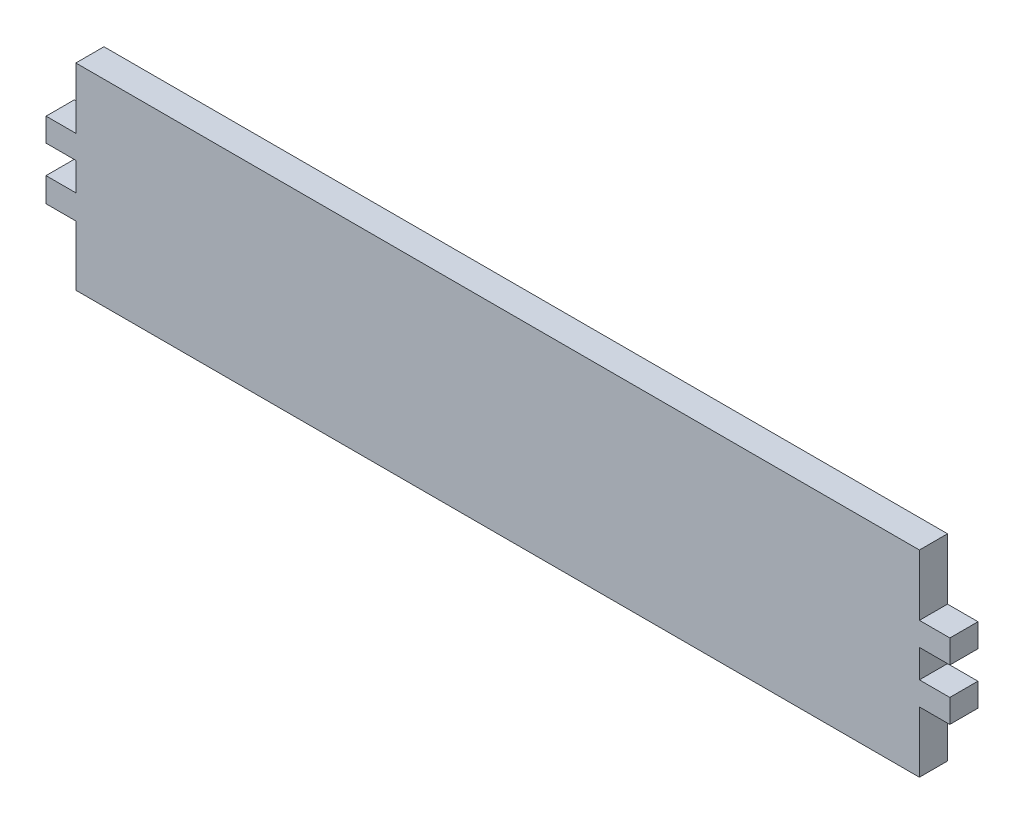
ISO-10303-21;
HEADER;
FILE_DESCRIPTION(('STEP AP214'),'2;1');
FILE_NAME('part.step','',(''),(''),'','','');
FILE_SCHEMA(('AUTOMOTIVE_DESIGN { 1 0 10303 214 1 1 1 1 }'));
ENDSEC;
DATA;
#1=APPLICATION_CONTEXT('core data for automotive mechanical design processes');
#2=APPLICATION_PROTOCOL_DEFINITION('international standard','automotive_design',2000,#1);
#3=PRODUCT_CONTEXT('',#1,'mechanical');
#4=PRODUCT('Part','Part','',(#3));
#5=PRODUCT_RELATED_PRODUCT_CATEGORY('part','',(#4));
#6=PRODUCT_DEFINITION_FORMATION('','',#4);
#7=PRODUCT_DEFINITION_CONTEXT('part definition',#1,'design');
#8=PRODUCT_DEFINITION('design','',#6,#7);
#9=PRODUCT_DEFINITION_SHAPE('','',#8);
#10=(LENGTH_UNIT() NAMED_UNIT(*) SI_UNIT(.MILLI.,.METRE.));
#11=(NAMED_UNIT(*) PLANE_ANGLE_UNIT() SI_UNIT($,.RADIAN.));
#12=(NAMED_UNIT(*) SI_UNIT($,.STERADIAN.) SOLID_ANGLE_UNIT());
#13=UNCERTAINTY_MEASURE_WITH_UNIT(LENGTH_MEASURE(1.E-05),#10,'distance_accuracy_value','');
#14=(GEOMETRIC_REPRESENTATION_CONTEXT(3) GLOBAL_UNCERTAINTY_ASSIGNED_CONTEXT((#13)) GLOBAL_UNIT_ASSIGNED_CONTEXT((#10,
#11,#12)) REPRESENTATION_CONTEXT('',''));
#15=CARTESIAN_POINT('',(0.,0.,0.));
#16=DIRECTION('',(0.,0.,1.));
#17=DIRECTION('',(1.,0.,0.));
#18=AXIS2_PLACEMENT_3D('',#15,#16,#17);
#19=CARTESIAN_POINT('',(-59.917123056119,16.2044558603052,6.));
#20=DIRECTION('',(1.,0.,0.));
#21=DIRECTION('',(0.,0.,-1.));
#22=AXIS2_PLACEMENT_3D('',#19,#20,#21);
#23=PLANE('',#22);
#24=DIRECTION('',(0.,-1.,0.));
#25=VECTOR('',#24,1.);
#26=CARTESIAN_POINT('',(-59.917123056119,16.2044558603052,0.));
#27=LINE('',#26,#25);
#28=CARTESIAN_POINT('',(-59.917123056119,29.2044558603051,0.));
#29=VERTEX_POINT('',#28);
#30=CARTESIAN_POINT('',(-59.917123056119,16.2044558603052,0.));
#31=VERTEX_POINT('',#30);
#32=EDGE_CURVE('E212',#29,#31,#27,.T.);
#33=ORIENTED_EDGE('',*,*,#32,.T.);
#34=DIRECTION('',(0.,0.,-1.));
#35=VECTOR('',#34,1.);
#36=CARTESIAN_POINT('',(-59.917123056119,16.2044558603052,6.));
#37=LINE('',#36,#35);
#38=CARTESIAN_POINT('',(-59.917123056119,16.2044558603052,6.));
#39=VERTEX_POINT('',#38);
#40=EDGE_CURVE('E11',#39,#31,#37,.T.);
#41=ORIENTED_EDGE('',*,*,#40,.F.);
#42=DIRECTION('',(0.,-1.,0.));
#43=VECTOR('',#42,1.);
#44=CARTESIAN_POINT('',(-59.917123056119,16.2044558603052,6.));
#45=LINE('',#44,#43);
#46=CARTESIAN_POINT('',(-59.917123056119,29.2044558603051,6.));
#47=VERTEX_POINT('',#46);
#48=EDGE_CURVE('E270',#47,#39,#45,.T.);
#49=ORIENTED_EDGE('',*,*,#48,.F.);
#50=DIRECTION('',(0.,0.,-1.));
#51=VECTOR('',#50,1.);
#52=CARTESIAN_POINT('',(-59.917123056119,29.2044558603051,6.));
#53=LINE('',#52,#51);
#54=EDGE_CURVE('E208',#47,#29,#53,.T.);
#55=ORIENTED_EDGE('',*,*,#54,.T.);
#56=EDGE_LOOP('',(#33,#41,#49,#55));
#57=FACE_BOUND('',#56,.T.);
#58=ADVANCED_FACE('F39',(#57),#23,.F.);
#59=CARTESIAN_POINT('',(-66.2684019347983,16.2044558603052,6.));
#60=DIRECTION('',(0.,-1.,0.));
#61=DIRECTION('',(0.,0.,-1.));
#62=AXIS2_PLACEMENT_3D('',#59,#60,#61);
#63=PLANE('',#62);
#64=DIRECTION('',(-1.,0.,0.));
#65=VECTOR('',#64,1.);
#66=CARTESIAN_POINT('',(-66.2684019347983,16.2044558603052,0.));
#67=LINE('',#66,#65);
#68=CARTESIAN_POINT('',(-66.2684019347983,16.2044558603052,0.));
#69=VERTEX_POINT('',#68);
#70=EDGE_CURVE('E216',#31,#69,#67,.T.);
#71=ORIENTED_EDGE('',*,*,#70,.T.);
#72=DIRECTION('',(0.,0.,-1.));
#73=VECTOR('',#72,1.);
#74=CARTESIAN_POINT('',(-66.2684019347983,16.2044558603052,6.));
#75=LINE('',#74,#73);
#76=CARTESIAN_POINT('',(-66.2684019347983,16.2044558603052,6.));
#77=VERTEX_POINT('',#76);
#78=EDGE_CURVE('E48',#77,#69,#75,.T.);
#79=ORIENTED_EDGE('',*,*,#78,.F.);
#80=DIRECTION('',(-1.,0.,0.));
#81=VECTOR('',#80,1.);
#82=CARTESIAN_POINT('',(-66.2684019347983,16.2044558603052,6.));
#83=LINE('',#82,#81);
#84=EDGE_CURVE('E135',#39,#77,#83,.T.);
#85=ORIENTED_EDGE('',*,*,#84,.F.);
#86=ORIENTED_EDGE('',*,*,#40,.T.);
#87=EDGE_LOOP('',(#71,#79,#85,#86));
#88=FACE_BOUND('',#87,.T.);
#89=ADVANCED_FACE('F420',(#88),#63,.F.);
#90=CARTESIAN_POINT('',(-66.2684019347983,11.2044558603052,6.));
#91=DIRECTION('',(1.,0.,0.));
#92=DIRECTION('',(0.,0.,-1.));
#93=AXIS2_PLACEMENT_3D('',#90,#91,#92);
#94=PLANE('',#93);
#95=DIRECTION('',(0.,-1.,0.));
#96=VECTOR('',#95,1.);
#97=CARTESIAN_POINT('',(-66.2684019347983,11.2044558603052,0.));
#98=LINE('',#97,#96);
#99=CARTESIAN_POINT('',(-66.2684019347983,11.2044558603052,0.));
#100=VERTEX_POINT('',#99);
#101=EDGE_CURVE('E219',#69,#100,#98,.T.);
#102=ORIENTED_EDGE('',*,*,#101,.T.);
#103=DIRECTION('',(0.,0.,-1.));
#104=VECTOR('',#103,1.);
#105=CARTESIAN_POINT('',(-66.2684019347983,11.2044558603052,6.));
#106=LINE('',#105,#104);
#107=CARTESIAN_POINT('',(-66.2684019347983,11.2044558603052,6.));
#108=VERTEX_POINT('',#107);
#109=EDGE_CURVE('E329',#108,#100,#106,.T.);
#110=ORIENTED_EDGE('',*,*,#109,.F.);
#111=DIRECTION('',(0.,-1.,0.));
#112=VECTOR('',#111,1.);
#113=CARTESIAN_POINT('',(-66.2684019347983,11.2044558603052,6.));
#114=LINE('',#113,#112);
#115=EDGE_CURVE('E339',#77,#108,#114,.T.);
#116=ORIENTED_EDGE('',*,*,#115,.F.);
#117=ORIENTED_EDGE('',*,*,#78,.T.);
#118=EDGE_LOOP('',(#102,#110,#116,#117));
#119=FACE_BOUND('',#118,.T.);
#120=ADVANCED_FACE('F337',(#119),#94,.F.);
#121=CARTESIAN_POINT('',(-59.917123056119,11.2044558603052,6.));
#122=DIRECTION('',(0.,1.,0.));
#123=DIRECTION('',(0.,0.,1.));
#124=AXIS2_PLACEMENT_3D('',#121,#122,#123);
#125=PLANE('',#124);
#126=DIRECTION('',(1.,0.,0.));
#127=VECTOR('',#126,1.);
#128=CARTESIAN_POINT('',(-59.917123056119,11.2044558603052,0.));
#129=LINE('',#128,#127);
#130=CARTESIAN_POINT('',(-59.917123056119,11.2044558603052,0.));
#131=VERTEX_POINT('',#130);
#132=EDGE_CURVE('E222',#100,#131,#129,.T.);
#133=ORIENTED_EDGE('',*,*,#132,.T.);
#134=DIRECTION('',(0.,0.,-1.));
#135=VECTOR('',#134,1.);
#136=CARTESIAN_POINT('',(-59.917123056119,11.2044558603052,6.));
#137=LINE('',#136,#135);
#138=CARTESIAN_POINT('',(-59.917123056119,11.2044558603052,6.));
#139=VERTEX_POINT('',#138);
#140=EDGE_CURVE('E325',#139,#131,#137,.T.);
#141=ORIENTED_EDGE('',*,*,#140,.F.);
#142=DIRECTION('',(1.,0.,0.));
#143=VECTOR('',#142,1.);
#144=CARTESIAN_POINT('',(-59.917123056119,11.2044558603052,6.));
#145=LINE('',#144,#143);
#146=EDGE_CURVE('E358',#108,#139,#145,.T.);
#147=ORIENTED_EDGE('',*,*,#146,.F.);
#148=ORIENTED_EDGE('',*,*,#109,.T.);
#149=EDGE_LOOP('',(#133,#141,#147,#148));
#150=FACE_BOUND('',#149,.T.);
#151=ADVANCED_FACE('F348',(#150),#125,.F.);
#152=CARTESIAN_POINT('',(-59.917123056119,5.20445586030515,6.));
#153=DIRECTION('',(1.,0.,0.));
#154=DIRECTION('',(0.,0.,-1.));
#155=AXIS2_PLACEMENT_3D('',#152,#153,#154);
#156=PLANE('',#155);
#157=DIRECTION('',(0.,-1.,0.));
#158=VECTOR('',#157,1.);
#159=CARTESIAN_POINT('',(-59.917123056119,5.20445586030515,0.));
#160=LINE('',#159,#158);
#161=CARTESIAN_POINT('',(-59.917123056119,5.20445586030515,0.));
#162=VERTEX_POINT('',#161);
#163=EDGE_CURVE('E225',#131,#162,#160,.T.);
#164=ORIENTED_EDGE('',*,*,#163,.T.);
#165=DIRECTION('',(0.,0.,-1.));
#166=VECTOR('',#165,1.);
#167=CARTESIAN_POINT('',(-59.917123056119,5.20445586030515,6.));
#168=LINE('',#167,#166);
#169=CARTESIAN_POINT('',(-59.917123056119,5.20445586030515,6.));
#170=VERTEX_POINT('',#169);
#171=EDGE_CURVE('E321',#170,#162,#168,.T.);
#172=ORIENTED_EDGE('',*,*,#171,.F.);
#173=DIRECTION('',(0.,-1.,0.));
#174=VECTOR('',#173,1.);
#175=CARTESIAN_POINT('',(-59.917123056119,5.20445586030515,6.));
#176=LINE('',#175,#174);
#177=EDGE_CURVE('E354',#139,#170,#176,.T.);
#178=ORIENTED_EDGE('',*,*,#177,.F.);
#179=ORIENTED_EDGE('',*,*,#140,.T.);
#180=EDGE_LOOP('',(#164,#172,#178,#179));
#181=FACE_BOUND('',#180,.T.);
#182=ADVANCED_FACE('F352',(#181),#156,.F.);
#183=CARTESIAN_POINT('',(-66.2861142104555,5.20445586030515,6.));
#184=DIRECTION('',(0.,-1.,0.));
#185=DIRECTION('',(0.,0.,-1.));
#186=AXIS2_PLACEMENT_3D('',#183,#184,#185);
#187=PLANE('',#186);
#188=DIRECTION('',(-1.,0.,0.));
#189=VECTOR('',#188,1.);
#190=CARTESIAN_POINT('',(-66.2861142104555,5.20445586030515,0.));
#191=LINE('',#190,#189);
#192=CARTESIAN_POINT('',(-66.2861142104555,5.20445586030515,0.));
#193=VERTEX_POINT('',#192);
#194=EDGE_CURVE('E228',#162,#193,#191,.T.);
#195=ORIENTED_EDGE('',*,*,#194,.T.);
#196=DIRECTION('',(0.,0.,-1.));
#197=VECTOR('',#196,1.);
#198=CARTESIAN_POINT('',(-66.2861142104555,5.20445586030515,6.));
#199=LINE('',#198,#197);
#200=CARTESIAN_POINT('',(-66.2861142104555,5.20445586030515,6.));
#201=VERTEX_POINT('',#200);
#202=EDGE_CURVE('E317',#201,#193,#199,.T.);
#203=ORIENTED_EDGE('',*,*,#202,.F.);
#204=DIRECTION('',(-1.,0.,0.));
#205=VECTOR('',#204,1.);
#206=CARTESIAN_POINT('',(-66.2861142104555,5.20445586030515,6.));
#207=LINE('',#206,#205);
#208=EDGE_CURVE('E357',#170,#201,#207,.T.);
#209=ORIENTED_EDGE('',*,*,#208,.F.);
#210=ORIENTED_EDGE('',*,*,#171,.T.);
#211=EDGE_LOOP('',(#195,#203,#209,#210));
#212=FACE_BOUND('',#211,.T.);
#213=ADVANCED_FACE('F433',(#212),#187,.F.);
#214=CARTESIAN_POINT('',(-66.2861142104555,0.,6.));
#215=DIRECTION('',(1.,0.,0.));
#216=DIRECTION('',(0.,0.,-1.));
#217=AXIS2_PLACEMENT_3D('',#214,#215,#216);
#218=PLANE('',#217);
#219=DIRECTION('',(0.,-1.,0.));
#220=VECTOR('',#219,1.);
#221=CARTESIAN_POINT('',(-66.2861142104555,0.,0.));
#222=LINE('',#221,#220);
#223=CARTESIAN_POINT('',(-66.2861142104555,0.,0.));
#224=VERTEX_POINT('',#223);
#225=EDGE_CURVE('E231',#193,#224,#222,.T.);
#226=ORIENTED_EDGE('',*,*,#225,.T.);
#227=DIRECTION('',(0.,0.,-1.));
#228=VECTOR('',#227,1.);
#229=CARTESIAN_POINT('',(-66.2861142104555,0.,6.));
#230=LINE('',#229,#228);
#231=CARTESIAN_POINT('',(-66.2861142104555,0.,6.));
#232=VERTEX_POINT('',#231);
#233=EDGE_CURVE('E313',#232,#224,#230,.T.);
#234=ORIENTED_EDGE('',*,*,#233,.F.);
#235=DIRECTION('',(0.,-1.,0.));
#236=VECTOR('',#235,1.);
#237=CARTESIAN_POINT('',(-66.2861142104555,0.,6.));
#238=LINE('',#237,#236);
#239=EDGE_CURVE('E362',#201,#232,#238,.T.);
#240=ORIENTED_EDGE('',*,*,#239,.F.);
#241=ORIENTED_EDGE('',*,*,#202,.T.);
#242=EDGE_LOOP('',(#226,#234,#240,#241));
#243=FACE_BOUND('',#242,.T.);
#244=ADVANCED_FACE('F436',(#243),#218,.F.);
#245=CARTESIAN_POINT('',(-59.917123056119,0.,6.));
#246=DIRECTION('',(0.,1.,0.));
#247=DIRECTION('',(0.,0.,1.));
#248=AXIS2_PLACEMENT_3D('',#245,#246,#247);
#249=PLANE('',#248);
#250=DIRECTION('',(1.,0.,0.));
#251=VECTOR('',#250,1.);
#252=CARTESIAN_POINT('',(-59.917123056119,0.,0.));
#253=LINE('',#252,#251);
#254=CARTESIAN_POINT('',(-59.917123056119,0.,0.));
#255=VERTEX_POINT('',#254);
#256=EDGE_CURVE('E234',#224,#255,#253,.T.);
#257=ORIENTED_EDGE('',*,*,#256,.T.);
#258=DIRECTION('',(0.,0.,-1.));
#259=VECTOR('',#258,1.);
#260=CARTESIAN_POINT('',(-59.917123056119,0.,6.));
#261=LINE('',#260,#259);
#262=CARTESIAN_POINT('',(-59.917123056119,0.,6.));
#263=VERTEX_POINT('',#262);
#264=EDGE_CURVE('E309',#263,#255,#261,.T.);
#265=ORIENTED_EDGE('',*,*,#264,.F.);
#266=DIRECTION('',(1.,0.,0.));
#267=VECTOR('',#266,1.);
#268=CARTESIAN_POINT('',(-59.917123056119,0.,6.));
#269=LINE('',#268,#267);
#270=EDGE_CURVE('E369',#232,#263,#269,.T.);
#271=ORIENTED_EDGE('',*,*,#270,.F.);
#272=ORIENTED_EDGE('',*,*,#233,.T.);
#273=EDGE_LOOP('',(#257,#265,#271,#272));
#274=FACE_BOUND('',#273,.T.);
#275=ADVANCED_FACE('F440',(#274),#249,.F.);
#276=CARTESIAN_POINT('',(-59.917123056119,-12.7955441396949,6.));
#277=DIRECTION('',(1.,0.,0.));
#278=DIRECTION('',(0.,0.,-1.));
#279=AXIS2_PLACEMENT_3D('',#276,#277,#278);
#280=PLANE('',#279);
#281=DIRECTION('',(0.,-1.,0.));
#282=VECTOR('',#281,1.);
#283=CARTESIAN_POINT('',(-59.917123056119,-12.7955441396949,0.));
#284=LINE('',#283,#282);
#285=CARTESIAN_POINT('',(-59.917123056119,-12.7955441396949,0.));
#286=VERTEX_POINT('',#285);
#287=EDGE_CURVE('E237',#255,#286,#284,.T.);
#288=ORIENTED_EDGE('',*,*,#287,.T.);
#289=DIRECTION('',(0.,0.,-1.));
#290=VECTOR('',#289,1.);
#291=CARTESIAN_POINT('',(-59.917123056119,-12.7955441396949,6.));
#292=LINE('',#291,#290);
#293=CARTESIAN_POINT('',(-59.917123056119,-12.7955441396949,6.));
#294=VERTEX_POINT('',#293);
#295=EDGE_CURVE('E305',#294,#286,#292,.T.);
#296=ORIENTED_EDGE('',*,*,#295,.F.);
#297=DIRECTION('',(0.,-1.,0.));
#298=VECTOR('',#297,1.);
#299=CARTESIAN_POINT('',(-59.917123056119,-12.7955441396949,6.));
#300=LINE('',#299,#298);
#301=EDGE_CURVE('E372',#263,#294,#300,.T.);
#302=ORIENTED_EDGE('',*,*,#301,.F.);
#303=ORIENTED_EDGE('',*,*,#264,.T.);
#304=EDGE_LOOP('',(#288,#296,#302,#303));
#305=FACE_BOUND('',#304,.T.);
#306=ADVANCED_FACE('F444',(#305),#280,.F.);
#307=CARTESIAN_POINT('',(120.082876943881,-12.7955441396949,6.));
#308=DIRECTION('',(0.,1.,0.));
#309=DIRECTION('',(0.,0.,1.));
#310=AXIS2_PLACEMENT_3D('',#307,#308,#309);
#311=PLANE('',#310);
#312=DIRECTION('',(1.,0.,0.));
#313=VECTOR('',#312,1.);
#314=CARTESIAN_POINT('',(120.082876943881,-12.7955441396949,0.));
#315=LINE('',#314,#313);
#316=CARTESIAN_POINT('',(120.082876943881,-12.7955441396949,0.));
#317=VERTEX_POINT('',#316);
#318=EDGE_CURVE('E240',#286,#317,#315,.T.);
#319=ORIENTED_EDGE('',*,*,#318,.T.);
#320=DIRECTION('',(0.,0.,-1.));
#321=VECTOR('',#320,1.);
#322=CARTESIAN_POINT('',(120.082876943881,-12.7955441396949,6.));
#323=LINE('',#322,#321);
#324=CARTESIAN_POINT('',(120.082876943881,-12.7955441396949,6.));
#325=VERTEX_POINT('',#324);
#326=EDGE_CURVE('E301',#325,#317,#323,.T.);
#327=ORIENTED_EDGE('',*,*,#326,.F.);
#328=DIRECTION('',(1.,0.,0.));
#329=VECTOR('',#328,1.);
#330=CARTESIAN_POINT('',(120.082876943881,-12.7955441396949,6.));
#331=LINE('',#330,#329);
#332=EDGE_CURVE('E375',#294,#325,#331,.T.);
#333=ORIENTED_EDGE('',*,*,#332,.F.);
#334=ORIENTED_EDGE('',*,*,#295,.T.);
#335=EDGE_LOOP('',(#319,#327,#333,#334));
#336=FACE_BOUND('',#335,.T.);
#337=ADVANCED_FACE('F448',(#336),#311,.F.);
#338=CARTESIAN_POINT('',(120.082876943881,-12.7955441396949,6.));
#339=DIRECTION('',(-1.,0.,0.));
#340=DIRECTION('',(0.,0.,1.));
#341=AXIS2_PLACEMENT_3D('',#338,#339,#340);
#342=PLANE('',#341);
#343=DIRECTION('',(0.,1.,0.));
#344=VECTOR('',#343,1.);
#345=CARTESIAN_POINT('',(120.082876943881,-12.7955441396949,0.));
#346=LINE('',#345,#344);
#347=CARTESIAN_POINT('',(120.082876943881,0.204455860305148,0.));
#348=VERTEX_POINT('',#347);
#349=EDGE_CURVE('E243',#317,#348,#346,.T.);
#350=ORIENTED_EDGE('',*,*,#349,.T.);
#351=DIRECTION('',(0.,0.,-1.));
#352=VECTOR('',#351,1.);
#353=CARTESIAN_POINT('',(120.082876943881,0.204455860305148,6.));
#354=LINE('',#353,#352);
#355=CARTESIAN_POINT('',(120.082876943881,0.204455860305148,6.));
#356=VERTEX_POINT('',#355);
#357=EDGE_CURVE('E297',#356,#348,#354,.T.);
#358=ORIENTED_EDGE('',*,*,#357,.F.);
#359=DIRECTION('',(0.,1.,0.));
#360=VECTOR('',#359,1.);
#361=CARTESIAN_POINT('',(120.082876943881,-12.7955441396949,6.));
#362=LINE('',#361,#360);
#363=EDGE_CURVE('E378',#325,#356,#362,.T.);
#364=ORIENTED_EDGE('',*,*,#363,.F.);
#365=ORIENTED_EDGE('',*,*,#326,.T.);
#366=EDGE_LOOP('',(#350,#358,#364,#365));
#367=FACE_BOUND('',#366,.T.);
#368=ADVANCED_FACE('F452',(#367),#342,.F.);
#369=CARTESIAN_POINT('',(120.082876943881,0.204455860305148,6.));
#370=DIRECTION('',(0.,1.,0.));
#371=DIRECTION('',(0.,0.,1.));
#372=AXIS2_PLACEMENT_3D('',#369,#370,#371);
#373=PLANE('',#372);
#374=DIRECTION('',(1.,0.,0.));
#375=VECTOR('',#374,1.);
#376=CARTESIAN_POINT('',(120.082876943881,0.204455860305148,0.));
#377=LINE('',#376,#375);
#378=CARTESIAN_POINT('',(126.566559382383,0.204455860305148,0.));
#379=VERTEX_POINT('',#378);
#380=EDGE_CURVE('E246',#348,#379,#377,.T.);
#381=ORIENTED_EDGE('',*,*,#380,.T.);
#382=DIRECTION('',(0.,0.,-1.));
#383=VECTOR('',#382,1.);
#384=CARTESIAN_POINT('',(126.566559382383,0.204455860305148,6.));
#385=LINE('',#384,#383);
#386=CARTESIAN_POINT('',(126.566559382383,0.204455860305148,6.));
#387=VERTEX_POINT('',#386);
#388=EDGE_CURVE('E293',#387,#379,#385,.T.);
#389=ORIENTED_EDGE('',*,*,#388,.F.);
#390=DIRECTION('',(1.,0.,0.));
#391=VECTOR('',#390,1.);
#392=CARTESIAN_POINT('',(120.082876943881,0.204455860305148,6.));
#393=LINE('',#392,#391);
#394=EDGE_CURVE('E381',#356,#387,#393,.T.);
#395=ORIENTED_EDGE('',*,*,#394,.F.);
#396=ORIENTED_EDGE('',*,*,#357,.T.);
#397=EDGE_LOOP('',(#381,#389,#395,#396));
#398=FACE_BOUND('',#397,.T.);
#399=ADVANCED_FACE('F456',(#398),#373,.F.);
#400=CARTESIAN_POINT('',(126.566559382383,0.204455860305148,6.));
#401=DIRECTION('',(-1.,0.,0.));
#402=DIRECTION('',(0.,0.,1.));
#403=AXIS2_PLACEMENT_3D('',#400,#401,#402);
#404=PLANE('',#403);
#405=DIRECTION('',(0.,1.,0.));
#406=VECTOR('',#405,1.);
#407=CARTESIAN_POINT('',(126.566559382383,0.204455860305148,0.));
#408=LINE('',#407,#406);
#409=CARTESIAN_POINT('',(126.566559382383,5.20445586030515,0.));
#410=VERTEX_POINT('',#409);
#411=EDGE_CURVE('E249',#379,#410,#408,.T.);
#412=ORIENTED_EDGE('',*,*,#411,.T.);
#413=DIRECTION('',(0.,0.,-1.));
#414=VECTOR('',#413,1.);
#415=CARTESIAN_POINT('',(126.566559382383,5.20445586030515,6.));
#416=LINE('',#415,#414);
#417=CARTESIAN_POINT('',(126.566559382383,5.20445586030515,6.));
#418=VERTEX_POINT('',#417);
#419=EDGE_CURVE('E289',#418,#410,#416,.T.);
#420=ORIENTED_EDGE('',*,*,#419,.F.);
#421=DIRECTION('',(0.,1.,0.));
#422=VECTOR('',#421,1.);
#423=CARTESIAN_POINT('',(126.566559382383,0.204455860305148,6.));
#424=LINE('',#423,#422);
#425=EDGE_CURVE('E384',#387,#418,#424,.T.);
#426=ORIENTED_EDGE('',*,*,#425,.F.);
#427=ORIENTED_EDGE('',*,*,#388,.T.);
#428=EDGE_LOOP('',(#412,#420,#426,#427));
#429=FACE_BOUND('',#428,.T.);
#430=ADVANCED_FACE('F460',(#429),#404,.F.);
#431=CARTESIAN_POINT('',(126.566559382383,5.20445586030515,6.));
#432=DIRECTION('',(0.,-1.,0.));
#433=DIRECTION('',(1.,0.,0.));
#434=AXIS2_PLACEMENT_3D('',#431,#432,#433);
#435=PLANE('',#434);
#436=DIRECTION('',(-1.,0.,0.));
#437=VECTOR('',#436,1.);
#438=CARTESIAN_POINT('',(126.566559382383,5.20445586030515,0.));
#439=LINE('',#438,#437);
#440=CARTESIAN_POINT('',(120.082876943881,5.20445586030515,0.));
#441=VERTEX_POINT('',#440);
#442=EDGE_CURVE('E252',#410,#441,#439,.T.);
#443=ORIENTED_EDGE('',*,*,#442,.T.);
#444=DIRECTION('',(0.,0.,-1.));
#445=VECTOR('',#444,1.);
#446=CARTESIAN_POINT('',(120.082876943881,5.20445586030515,6.));
#447=LINE('',#446,#445);
#448=CARTESIAN_POINT('',(120.082876943881,5.20445586030515,6.));
#449=VERTEX_POINT('',#448);
#450=EDGE_CURVE('E285',#449,#441,#447,.T.);
#451=ORIENTED_EDGE('',*,*,#450,.F.);
#452=DIRECTION('',(-1.,0.,0.));
#453=VECTOR('',#452,1.);
#454=CARTESIAN_POINT('',(126.566559382383,5.20445586030515,6.));
#455=LINE('',#454,#453);
#456=EDGE_CURVE('E387',#418,#449,#455,.T.);
#457=ORIENTED_EDGE('',*,*,#456,.F.);
#458=ORIENTED_EDGE('',*,*,#419,.T.);
#459=EDGE_LOOP('',(#443,#451,#457,#458));
#460=FACE_BOUND('',#459,.T.);
#461=ADVANCED_FACE('F464',(#460),#435,.F.);
#462=CARTESIAN_POINT('',(120.082876943881,5.20445586030515,6.));
#463=DIRECTION('',(-1.,0.,0.));
#464=DIRECTION('',(0.,0.,1.));
#465=AXIS2_PLACEMENT_3D('',#462,#463,#464);
#466=PLANE('',#465);
#467=DIRECTION('',(0.,1.,0.));
#468=VECTOR('',#467,1.);
#469=CARTESIAN_POINT('',(120.082876943881,5.20445586030515,0.));
#470=LINE('',#469,#468);
#471=CARTESIAN_POINT('',(120.082876943881,11.2044558603052,0.));
#472=VERTEX_POINT('',#471);
#473=EDGE_CURVE('E255',#441,#472,#470,.T.);
#474=ORIENTED_EDGE('',*,*,#473,.T.);
#475=DIRECTION('',(0.,0.,-1.));
#476=VECTOR('',#475,1.);
#477=CARTESIAN_POINT('',(120.082876943881,11.2044558603052,6.));
#478=LINE('',#477,#476);
#479=CARTESIAN_POINT('',(120.082876943881,11.2044558603052,6.));
#480=VERTEX_POINT('',#479);
#481=EDGE_CURVE('E281',#480,#472,#478,.T.);
#482=ORIENTED_EDGE('',*,*,#481,.F.);
#483=DIRECTION('',(0.,1.,0.));
#484=VECTOR('',#483,1.);
#485=CARTESIAN_POINT('',(120.082876943881,5.20445586030515,6.));
#486=LINE('',#485,#484);
#487=EDGE_CURVE('E390',#449,#480,#486,.T.);
#488=ORIENTED_EDGE('',*,*,#487,.F.);
#489=ORIENTED_EDGE('',*,*,#450,.T.);
#490=EDGE_LOOP('',(#474,#482,#488,#489));
#491=FACE_BOUND('',#490,.T.);
#492=ADVANCED_FACE('F468',(#491),#466,.F.);
#493=CARTESIAN_POINT('',(126.58490102002,11.2044558603052,6.));
#494=DIRECTION('',(0.,1.,0.));
#495=DIRECTION('',(0.,0.,1.));
#496=AXIS2_PLACEMENT_3D('',#493,#494,#495);
#497=PLANE('',#496);
#498=DIRECTION('',(1.,0.,0.));
#499=VECTOR('',#498,1.);
#500=CARTESIAN_POINT('',(126.58490102002,11.2044558603052,0.));
#501=LINE('',#500,#499);
#502=CARTESIAN_POINT('',(126.58490102002,11.2044558603052,0.));
#503=VERTEX_POINT('',#502);
#504=EDGE_CURVE('E258',#472,#503,#501,.T.);
#505=ORIENTED_EDGE('',*,*,#504,.T.);
#506=DIRECTION('',(0.,0.,-1.));
#507=VECTOR('',#506,1.);
#508=CARTESIAN_POINT('',(126.58490102002,11.2044558603052,6.));
#509=LINE('',#508,#507);
#510=CARTESIAN_POINT('',(126.58490102002,11.2044558603052,6.));
#511=VERTEX_POINT('',#510);
#512=EDGE_CURVE('E277',#511,#503,#509,.T.);
#513=ORIENTED_EDGE('',*,*,#512,.F.);
#514=DIRECTION('',(1.,0.,0.));
#515=VECTOR('',#514,1.);
#516=CARTESIAN_POINT('',(126.58490102002,11.2044558603052,6.));
#517=LINE('',#516,#515);
#518=EDGE_CURVE('E393',#480,#511,#517,.T.);
#519=ORIENTED_EDGE('',*,*,#518,.F.);
#520=ORIENTED_EDGE('',*,*,#481,.T.);
#521=EDGE_LOOP('',(#505,#513,#519,#520));
#522=FACE_BOUND('',#521,.T.);
#523=ADVANCED_FACE('F401',(#522),#497,.F.);
#524=CARTESIAN_POINT('',(126.58490102002,16.2044558603052,6.));
#525=DIRECTION('',(-1.,0.,0.));
#526=DIRECTION('',(0.,0.,1.));
#527=AXIS2_PLACEMENT_3D('',#524,#525,#526);
#528=PLANE('',#527);
#529=DIRECTION('',(0.,1.,0.));
#530=VECTOR('',#529,1.);
#531=CARTESIAN_POINT('',(126.58490102002,16.2044558603052,0.));
#532=LINE('',#531,#530);
#533=CARTESIAN_POINT('',(126.58490102002,16.2044558603052,0.));
#534=VERTEX_POINT('',#533);
#535=EDGE_CURVE('E261',#503,#534,#532,.T.);
#536=ORIENTED_EDGE('',*,*,#535,.T.);
#537=DIRECTION('',(0.,0.,-1.));
#538=VECTOR('',#537,1.);
#539=CARTESIAN_POINT('',(126.58490102002,16.2044558603052,6.));
#540=LINE('',#539,#538);
#541=CARTESIAN_POINT('',(126.58490102002,16.2044558603052,6.));
#542=VERTEX_POINT('',#541);
#543=EDGE_CURVE('E201',#542,#534,#540,.T.);
#544=ORIENTED_EDGE('',*,*,#543,.F.);
#545=DIRECTION('',(0.,1.,0.));
#546=VECTOR('',#545,1.);
#547=CARTESIAN_POINT('',(126.58490102002,16.2044558603052,6.));
#548=LINE('',#547,#546);
#549=EDGE_CURVE('E190',#511,#542,#548,.T.);
#550=ORIENTED_EDGE('',*,*,#549,.F.);
#551=ORIENTED_EDGE('',*,*,#512,.T.);
#552=EDGE_LOOP('',(#536,#544,#550,#551));
#553=FACE_BOUND('',#552,.T.);
#554=ADVANCED_FACE('F405',(#553),#528,.F.);
#555=CARTESIAN_POINT('',(120.082876943881,16.2044558603052,6.));
#556=DIRECTION('',(0.,-1.,0.));
#557=DIRECTION('',(0.,0.,-1.));
#558=AXIS2_PLACEMENT_3D('',#555,#556,#557);
#559=PLANE('',#558);
#560=DIRECTION('',(-1.,0.,0.));
#561=VECTOR('',#560,1.);
#562=CARTESIAN_POINT('',(120.082876943881,16.2044558603052,0.));
#563=LINE('',#562,#561);
#564=CARTESIAN_POINT('',(120.082876943881,16.2044558603052,0.));
#565=VERTEX_POINT('',#564);
#566=EDGE_CURVE('E199',#534,#565,#563,.T.);
#567=ORIENTED_EDGE('',*,*,#566,.T.);
#568=DIRECTION('',(0.,0.,-1.));
#569=VECTOR('',#568,1.);
#570=CARTESIAN_POINT('',(120.082876943881,16.2044558603052,6.));
#571=LINE('',#570,#569);
#572=CARTESIAN_POINT('',(120.082876943881,16.2044558603052,6.));
#573=VERTEX_POINT('',#572);
#574=EDGE_CURVE('E196',#573,#565,#571,.T.);
#575=ORIENTED_EDGE('',*,*,#574,.F.);
#576=DIRECTION('',(-1.,0.,0.));
#577=VECTOR('',#576,1.);
#578=CARTESIAN_POINT('',(120.082876943881,16.2044558603052,6.));
#579=LINE('',#578,#577);
#580=EDGE_CURVE('E184',#542,#573,#579,.T.);
#581=ORIENTED_EDGE('',*,*,#580,.F.);
#582=ORIENTED_EDGE('',*,*,#543,.T.);
#583=EDGE_LOOP('',(#567,#575,#581,#582));
#584=FACE_BOUND('',#583,.T.);
#585=ADVANCED_FACE('F197',(#584),#559,.F.);
#586=CARTESIAN_POINT('',(120.082876943881,29.2044558603051,6.));
#587=DIRECTION('',(-1.,0.,0.));
#588=DIRECTION('',(0.,0.,1.));
#589=AXIS2_PLACEMENT_3D('',#586,#587,#588);
#590=PLANE('',#589);
#591=DIRECTION('',(0.,1.,0.));
#592=VECTOR('',#591,1.);
#593=CARTESIAN_POINT('',(120.082876943881,29.2044558603051,0.));
#594=LINE('',#593,#592);
#595=CARTESIAN_POINT('',(120.082876943881,29.2044558603051,0.));
#596=VERTEX_POINT('',#595);
#597=EDGE_CURVE('E121',#565,#596,#594,.T.);
#598=ORIENTED_EDGE('',*,*,#597,.T.);
#599=DIRECTION('',(0.,0.,-1.));
#600=VECTOR('',#599,1.);
#601=CARTESIAN_POINT('',(120.082876943881,29.2044558603051,6.));
#602=LINE('',#601,#600);
#603=CARTESIAN_POINT('',(120.082876943881,29.2044558603051,6.));
#604=VERTEX_POINT('',#603);
#605=EDGE_CURVE('E202',#604,#596,#602,.T.);
#606=ORIENTED_EDGE('',*,*,#605,.F.);
#607=DIRECTION('',(0.,1.,0.));
#608=VECTOR('',#607,1.);
#609=CARTESIAN_POINT('',(120.082876943881,29.2044558603051,6.));
#610=LINE('',#609,#608);
#611=EDGE_CURVE('E188',#573,#604,#610,.T.);
#612=ORIENTED_EDGE('',*,*,#611,.F.);
#613=ORIENTED_EDGE('',*,*,#574,.T.);
#614=EDGE_LOOP('',(#598,#606,#612,#613));
#615=FACE_BOUND('',#614,.T.);
#616=ADVANCED_FACE('F204',(#615),#590,.F.);
#617=CARTESIAN_POINT('',(-59.917123056119,29.2044558603051,6.));
#618=DIRECTION('',(0.,-1.,0.));
#619=DIRECTION('',(0.,0.,-1.));
#620=AXIS2_PLACEMENT_3D('',#617,#618,#619);
#621=PLANE('',#620);
#622=DIRECTION('',(-1.,0.,0.));
#623=VECTOR('',#622,1.);
#624=CARTESIAN_POINT('',(-59.917123056119,29.2044558603051,0.));
#625=LINE('',#624,#623);
#626=EDGE_CURVE('E127',#596,#29,#625,.T.);
#627=ORIENTED_EDGE('',*,*,#626,.T.);
#628=ORIENTED_EDGE('',*,*,#54,.F.);
#629=DIRECTION('',(-1.,0.,0.));
#630=VECTOR('',#629,1.);
#631=CARTESIAN_POINT('',(-59.917123056119,29.2044558603051,6.));
#632=LINE('',#631,#630);
#633=EDGE_CURVE('E56',#604,#47,#632,.T.);
#634=ORIENTED_EDGE('',*,*,#633,.F.);
#635=ORIENTED_EDGE('',*,*,#605,.T.);
#636=EDGE_LOOP('',(#627,#628,#634,#635));
#637=FACE_BOUND('',#636,.T.);
#638=ADVANCED_FACE('F409',(#637),#621,.F.);
#639=CARTESIAN_POINT('',(0.,0.,6.));
#640=DIRECTION('',(0.,0.,-1.));
#641=DIRECTION('',(-1.,0.,0.));
#642=AXIS2_PLACEMENT_3D('',#639,#640,#641);
#643=PLANE('',#642);
#644=ORIENTED_EDGE('',*,*,#48,.T.);
#645=ORIENTED_EDGE('',*,*,#84,.T.);
#646=ORIENTED_EDGE('',*,*,#115,.T.);
#647=ORIENTED_EDGE('',*,*,#146,.T.);
#648=ORIENTED_EDGE('',*,*,#177,.T.);
#649=ORIENTED_EDGE('',*,*,#208,.T.);
#650=ORIENTED_EDGE('',*,*,#239,.T.);
#651=ORIENTED_EDGE('',*,*,#270,.T.);
#652=ORIENTED_EDGE('',*,*,#301,.T.);
#653=ORIENTED_EDGE('',*,*,#332,.T.);
#654=ORIENTED_EDGE('',*,*,#363,.T.);
#655=ORIENTED_EDGE('',*,*,#394,.T.);
#656=ORIENTED_EDGE('',*,*,#425,.T.);
#657=ORIENTED_EDGE('',*,*,#456,.T.);
#658=ORIENTED_EDGE('',*,*,#487,.T.);
#659=ORIENTED_EDGE('',*,*,#518,.T.);
#660=ORIENTED_EDGE('',*,*,#549,.T.);
#661=ORIENTED_EDGE('',*,*,#580,.T.);
#662=ORIENTED_EDGE('',*,*,#611,.T.);
#663=ORIENTED_EDGE('',*,*,#633,.T.);
#664=EDGE_LOOP('',(#644,#645,#646,#647,#648,#649,#650,#651,#652,#653,#654,#655,#656,#657,#658,
#659,#660,#661,#662,#663));
#665=FACE_BOUND('',#664,.T.);
#666=ADVANCED_FACE('F186',(#665),#643,.F.);
#667=CARTESIAN_POINT('',(0.,0.,0.));
#668=DIRECTION('',(0.,0.,-1.));
#669=DIRECTION('',(-1.,0.,0.));
#670=AXIS2_PLACEMENT_3D('',#667,#668,#669);
#671=PLANE('',#670);
#672=ORIENTED_EDGE('',*,*,#32,.F.);
#673=ORIENTED_EDGE('',*,*,#626,.F.);
#674=ORIENTED_EDGE('',*,*,#597,.F.);
#675=ORIENTED_EDGE('',*,*,#566,.F.);
#676=ORIENTED_EDGE('',*,*,#535,.F.);
#677=ORIENTED_EDGE('',*,*,#504,.F.);
#678=ORIENTED_EDGE('',*,*,#473,.F.);
#679=ORIENTED_EDGE('',*,*,#442,.F.);
#680=ORIENTED_EDGE('',*,*,#411,.F.);
#681=ORIENTED_EDGE('',*,*,#380,.F.);
#682=ORIENTED_EDGE('',*,*,#349,.F.);
#683=ORIENTED_EDGE('',*,*,#318,.F.);
#684=ORIENTED_EDGE('',*,*,#287,.F.);
#685=ORIENTED_EDGE('',*,*,#256,.F.);
#686=ORIENTED_EDGE('',*,*,#225,.F.);
#687=ORIENTED_EDGE('',*,*,#194,.F.);
#688=ORIENTED_EDGE('',*,*,#163,.F.);
#689=ORIENTED_EDGE('',*,*,#132,.F.);
#690=ORIENTED_EDGE('',*,*,#101,.F.);
#691=ORIENTED_EDGE('',*,*,#70,.F.);
#692=EDGE_LOOP('',(#672,#673,#674,#675,#676,#677,#678,#679,#680,#681,#682,#683,#684,#685,#686,
#687,#688,#689,#690,#691));
#693=FACE_BOUND('',#692,.T.);
#694=ADVANCED_FACE('F343',(#693),#671,.T.);
#695=CLOSED_SHELL('',(#58,#89,#120,#151,#182,#213,#244,#275,#306,#337,#368,#399,#430,#461,#492,
#523,#554,#585,#616,#638,#666,#694));
#696=MANIFOLD_SOLID_BREP('B2',#695);
#697=ADVANCED_BREP_SHAPE_REPRESENTATION('',(#18,#696),#14);
#698=SHAPE_DEFINITION_REPRESENTATION(#9,#697);
ENDSEC;
END-ISO-10303-21;
